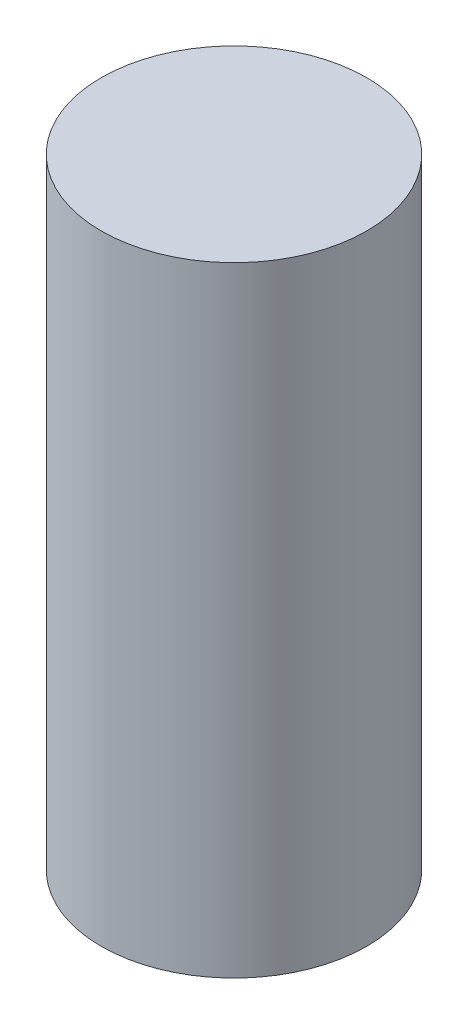
ISO-10303-21;
HEADER;
FILE_DESCRIPTION(('STEP AP214'),'2;1');
FILE_NAME('part.step','',(''),(''),'','','');
FILE_SCHEMA(('AUTOMOTIVE_DESIGN { 1 0 10303 214 1 1 1 1 }'));
ENDSEC;
DATA;
#1=APPLICATION_CONTEXT('core data for automotive mechanical design processes');
#2=APPLICATION_PROTOCOL_DEFINITION('international standard','automotive_design',2000,#1);
#3=PRODUCT_CONTEXT('',#1,'mechanical');
#4=PRODUCT('Part','Part','',(#3));
#5=PRODUCT_RELATED_PRODUCT_CATEGORY('part','',(#4));
#6=PRODUCT_DEFINITION_FORMATION('','',#4);
#7=PRODUCT_DEFINITION_CONTEXT('part definition',#1,'design');
#8=PRODUCT_DEFINITION('design','',#6,#7);
#9=PRODUCT_DEFINITION_SHAPE('','',#8);
#10=(LENGTH_UNIT() NAMED_UNIT(*) SI_UNIT(.MILLI.,.METRE.));
#11=(NAMED_UNIT(*) PLANE_ANGLE_UNIT() SI_UNIT($,.RADIAN.));
#12=(NAMED_UNIT(*) SI_UNIT($,.STERADIAN.) SOLID_ANGLE_UNIT());
#13=UNCERTAINTY_MEASURE_WITH_UNIT(LENGTH_MEASURE(1.E-05),#10,'distance_accuracy_value','');
#14=(GEOMETRIC_REPRESENTATION_CONTEXT(3) GLOBAL_UNCERTAINTY_ASSIGNED_CONTEXT((#13)) GLOBAL_UNIT_ASSIGNED_CONTEXT((#10,
#11,#12)) REPRESENTATION_CONTEXT('',''));
#15=CARTESIAN_POINT('',(0.,0.,0.));
#16=DIRECTION('',(0.,0.,1.));
#17=DIRECTION('',(1.,0.,0.));
#18=AXIS2_PLACEMENT_3D('',#15,#16,#17);
#19=CARTESIAN_POINT('',(0.,88.9,0.));
#20=DIRECTION('',(0.,-1.,0.));
#21=DIRECTION('',(0.,0.,-1.));
#22=AXIS2_PLACEMENT_3D('',#19,#20,#21);
#23=CYLINDRICAL_SURFACE('',#22,19.05);
#24=CARTESIAN_POINT('',(0.,88.9,0.));
#25=DIRECTION('',(0.,1.,0.));
#26=DIRECTION('',(0.,0.,1.));
#27=AXIS2_PLACEMENT_3D('',#24,#25,#26);
#28=CIRCLE('',#27,19.05);
#29=CARTESIAN_POINT('',(0.,88.9,19.05));
#30=VERTEX_POINT('',#29);
#31=EDGE_CURVE('E10',#30,#30,#28,.T.);
#32=ORIENTED_EDGE('',*,*,#31,.F.);
#33=EDGE_LOOP('',(#32));
#34=FACE_BOUND('',#33,.T.);
#35=CARTESIAN_POINT('',(0.,0.,0.));
#36=DIRECTION('',(0.,1.,0.));
#37=DIRECTION('',(0.,0.,1.));
#38=AXIS2_PLACEMENT_3D('',#35,#36,#37);
#39=CIRCLE('',#38,19.05);
#40=CARTESIAN_POINT('',(0.,0.,19.05));
#41=VERTEX_POINT('',#40);
#42=EDGE_CURVE('E18',#41,#41,#39,.T.);
#43=ORIENTED_EDGE('',*,*,#42,.T.);
#44=EDGE_LOOP('',(#43));
#45=FACE_BOUND('',#44,.T.);
#46=ADVANCED_FACE('F15',(#34,#45),#23,.T.);
#47=CARTESIAN_POINT('',(0.,88.9,0.));
#48=DIRECTION('',(0.,1.,0.));
#49=DIRECTION('',(0.,0.,1.));
#50=AXIS2_PLACEMENT_3D('',#47,#48,#49);
#51=PLANE('',#50);
#52=ORIENTED_EDGE('',*,*,#31,.T.);
#53=EDGE_LOOP('',(#52));
#54=FACE_BOUND('',#53,.T.);
#55=ADVANCED_FACE('F30',(#54),#51,.T.);
#56=CARTESIAN_POINT('',(0.,0.,0.));
#57=DIRECTION('',(0.,1.,0.));
#58=DIRECTION('',(0.,0.,1.));
#59=AXIS2_PLACEMENT_3D('',#56,#57,#58);
#60=PLANE('',#59);
#61=ORIENTED_EDGE('',*,*,#42,.F.);
#62=EDGE_LOOP('',(#61));
#63=FACE_BOUND('',#62,.T.);
#64=ADVANCED_FACE('F28',(#63),#60,.F.);
#65=CLOSED_SHELL('',(#46,#55,#64));
#66=MANIFOLD_SOLID_BREP('B1',#65);
#67=ADVANCED_BREP_SHAPE_REPRESENTATION('',(#18,#66),#14);
#68=SHAPE_DEFINITION_REPRESENTATION(#9,#67);
ENDSEC;
END-ISO-10303-21;
